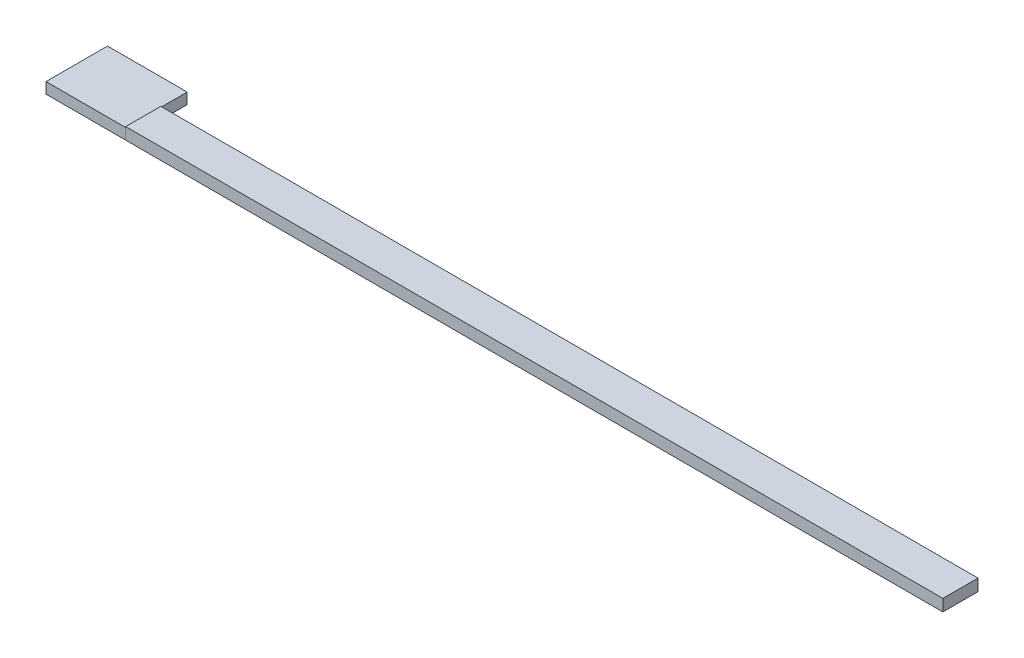
ISO-10303-21;
HEADER;
FILE_DESCRIPTION(('STEP AP214'),'2;1');
FILE_NAME('part.step','',(''),(''),'','','');
FILE_SCHEMA(('AUTOMOTIVE_DESIGN { 1 0 10303 214 1 1 1 1 }'));
ENDSEC;
DATA;
#1=APPLICATION_CONTEXT('core data for automotive mechanical design processes');
#2=APPLICATION_PROTOCOL_DEFINITION('international standard','automotive_design',2000,#1);
#3=PRODUCT_CONTEXT('',#1,'mechanical');
#4=PRODUCT('Part','Part','',(#3));
#5=PRODUCT_RELATED_PRODUCT_CATEGORY('part','',(#4));
#6=PRODUCT_DEFINITION_FORMATION('','',#4);
#7=PRODUCT_DEFINITION_CONTEXT('part definition',#1,'design');
#8=PRODUCT_DEFINITION('design','',#6,#7);
#9=PRODUCT_DEFINITION_SHAPE('','',#8);
#10=(LENGTH_UNIT() NAMED_UNIT(*) SI_UNIT(.MILLI.,.METRE.));
#11=(NAMED_UNIT(*) PLANE_ANGLE_UNIT() SI_UNIT($,.RADIAN.));
#12=(NAMED_UNIT(*) SI_UNIT($,.STERADIAN.) SOLID_ANGLE_UNIT());
#13=UNCERTAINTY_MEASURE_WITH_UNIT(LENGTH_MEASURE(1.E-05),#10,'distance_accuracy_value','');
#14=(GEOMETRIC_REPRESENTATION_CONTEXT(3) GLOBAL_UNCERTAINTY_ASSIGNED_CONTEXT((#13)) GLOBAL_UNIT_ASSIGNED_CONTEXT((#10,
#11,#12)) REPRESENTATION_CONTEXT('',''));
#15=CARTESIAN_POINT('',(0.,0.,0.));
#16=DIRECTION('',(0.,0.,1.));
#17=DIRECTION('',(1.,0.,0.));
#18=AXIS2_PLACEMENT_3D('',#15,#16,#17);
#19=CARTESIAN_POINT('',(40.,5.9,0.));
#20=DIRECTION('',(1.,0.,0.));
#21=DIRECTION('',(0.,0.,-1.));
#22=AXIS2_PLACEMENT_3D('',#19,#20,#21);
#23=PLANE('',#22);
#24=DIRECTION('',(0.,0.,1.));
#25=VECTOR('',#24,1.);
#26=CARTESIAN_POINT('',(40.,0.,0.));
#27=LINE('',#26,#25);
#28=CARTESIAN_POINT('',(40.,0.,-17.6194476069429));
#29=VERTEX_POINT('',#28);
#30=CARTESIAN_POINT('',(40.,0.,0.));
#31=VERTEX_POINT('',#30);
#32=EDGE_CURVE('E106',#29,#31,#27,.T.);
#33=ORIENTED_EDGE('',*,*,#32,.T.);
#34=DIRECTION('',(0.,-1.,0.));
#35=VECTOR('',#34,1.);
#36=CARTESIAN_POINT('',(40.,5.9,0.));
#37=LINE('',#36,#35);
#38=CARTESIAN_POINT('',(40.,5.9,0.));
#39=VERTEX_POINT('',#38);
#40=EDGE_CURVE('E12',#39,#31,#37,.T.);
#41=ORIENTED_EDGE('',*,*,#40,.F.);
#42=DIRECTION('',(0.,0.,1.));
#43=VECTOR('',#42,1.);
#44=CARTESIAN_POINT('',(40.,5.9,0.));
#45=LINE('',#44,#43);
#46=CARTESIAN_POINT('',(40.,5.9,-17.6194476069429));
#47=VERTEX_POINT('',#46);
#48=EDGE_CURVE('E94',#47,#39,#45,.T.);
#49=ORIENTED_EDGE('',*,*,#48,.F.);
#50=DIRECTION('',(0.,-1.,0.));
#51=VECTOR('',#50,1.);
#52=CARTESIAN_POINT('',(40.,5.9,-17.6194476069429));
#53=LINE('',#52,#51);
#54=EDGE_CURVE('E102',#47,#29,#53,.T.);
#55=ORIENTED_EDGE('',*,*,#54,.T.);
#56=EDGE_LOOP('',(#33,#41,#49,#55));
#57=FACE_BOUND('',#56,.T.);
#58=ADVANCED_FACE('F43',(#57),#23,.F.);
#59=CARTESIAN_POINT('',(40.,5.9,0.));
#60=DIRECTION('',(0.,0.,-1.));
#61=DIRECTION('',(-1.,0.,0.));
#62=AXIS2_PLACEMENT_3D('',#59,#60,#61);
#63=PLANE('',#62);
#64=DIRECTION('',(1.,0.,0.));
#65=VECTOR('',#64,1.);
#66=CARTESIAN_POINT('',(40.,0.,0.));
#67=LINE('',#66,#65);
#68=CARTESIAN_POINT('',(450.,0.,0.));
#69=VERTEX_POINT('',#68);
#70=EDGE_CURVE('E98',#31,#69,#67,.T.);
#71=ORIENTED_EDGE('',*,*,#70,.T.);
#72=DIRECTION('',(0.,-1.,0.));
#73=VECTOR('',#72,1.);
#74=CARTESIAN_POINT('',(450.,5.9,0.));
#75=LINE('',#74,#73);
#76=CARTESIAN_POINT('',(450.,5.9,0.));
#77=VERTEX_POINT('',#76);
#78=EDGE_CURVE('E51',#77,#69,#75,.T.);
#79=ORIENTED_EDGE('',*,*,#78,.F.);
#80=DIRECTION('',(1.,0.,0.));
#81=VECTOR('',#80,1.);
#82=CARTESIAN_POINT('',(40.,5.9,0.));
#83=LINE('',#82,#81);
#84=EDGE_CURVE('E89',#39,#77,#83,.T.);
#85=ORIENTED_EDGE('',*,*,#84,.F.);
#86=ORIENTED_EDGE('',*,*,#40,.T.);
#87=EDGE_LOOP('',(#71,#79,#85,#86));
#88=FACE_BOUND('',#87,.T.);
#89=ADVANCED_FACE('F97',(#88),#63,.F.);
#90=CARTESIAN_POINT('',(450.,5.9,0.));
#91=DIRECTION('',(-1.,0.,0.));
#92=DIRECTION('',(0.,0.,1.));
#93=AXIS2_PLACEMENT_3D('',#90,#91,#92);
#94=PLANE('',#93);
#95=DIRECTION('',(0.,0.,-1.));
#96=VECTOR('',#95,1.);
#97=CARTESIAN_POINT('',(450.,0.,0.));
#98=LINE('',#97,#96);
#99=CARTESIAN_POINT('',(450.,0.,-17.6194476069429));
#100=VERTEX_POINT('',#99);
#101=EDGE_CURVE('E76',#69,#100,#98,.T.);
#102=ORIENTED_EDGE('',*,*,#101,.T.);
#103=DIRECTION('',(0.,-1.,0.));
#104=VECTOR('',#103,1.);
#105=CARTESIAN_POINT('',(450.,5.9,-17.6194476069429));
#106=LINE('',#105,#104);
#107=CARTESIAN_POINT('',(450.,5.9,-17.6194476069429));
#108=VERTEX_POINT('',#107);
#109=EDGE_CURVE('E99',#108,#100,#106,.T.);
#110=ORIENTED_EDGE('',*,*,#109,.F.);
#111=DIRECTION('',(0.,0.,-1.));
#112=VECTOR('',#111,1.);
#113=CARTESIAN_POINT('',(450.,5.9,0.));
#114=LINE('',#113,#112);
#115=EDGE_CURVE('E92',#77,#108,#114,.T.);
#116=ORIENTED_EDGE('',*,*,#115,.F.);
#117=ORIENTED_EDGE('',*,*,#78,.T.);
#118=EDGE_LOOP('',(#102,#110,#116,#117));
#119=FACE_BOUND('',#118,.T.);
#120=ADVANCED_FACE('F100',(#119),#94,.F.);
#121=CARTESIAN_POINT('',(40.,5.9,-17.6194476069429));
#122=DIRECTION('',(0.,0.,1.));
#123=DIRECTION('',(1.,0.,0.));
#124=AXIS2_PLACEMENT_3D('',#121,#122,#123);
#125=PLANE('',#124);
#126=DIRECTION('',(-1.,0.,0.));
#127=VECTOR('',#126,1.);
#128=CARTESIAN_POINT('',(40.,0.,-17.6194476069429));
#129=LINE('',#128,#127);
#130=EDGE_CURVE('E82',#100,#29,#129,.T.);
#131=ORIENTED_EDGE('',*,*,#130,.T.);
#132=ORIENTED_EDGE('',*,*,#54,.F.);
#133=DIRECTION('',(-1.,0.,0.));
#134=VECTOR('',#133,1.);
#135=CARTESIAN_POINT('',(40.,5.9,-17.6194476069429));
#136=LINE('',#135,#134);
#137=EDGE_CURVE('E59',#108,#47,#136,.T.);
#138=ORIENTED_EDGE('',*,*,#137,.F.);
#139=ORIENTED_EDGE('',*,*,#109,.T.);
#140=EDGE_LOOP('',(#131,#132,#138,#139));
#141=FACE_BOUND('',#140,.T.);
#142=ADVANCED_FACE('F113',(#141),#125,.F.);
#143=CARTESIAN_POINT('',(0.,5.9,0.));
#144=DIRECTION('',(0.,-1.,0.));
#145=DIRECTION('',(0.,0.,-1.));
#146=AXIS2_PLACEMENT_3D('',#143,#144,#145);
#147=PLANE('',#146);
#148=ORIENTED_EDGE('',*,*,#48,.T.);
#149=ORIENTED_EDGE('',*,*,#84,.T.);
#150=ORIENTED_EDGE('',*,*,#115,.T.);
#151=ORIENTED_EDGE('',*,*,#137,.T.);
#152=EDGE_LOOP('',(#148,#149,#150,#151));
#153=FACE_BOUND('',#152,.T.);
#154=ADVANCED_FACE('F90',(#153),#147,.F.);
#155=CARTESIAN_POINT('',(0.,0.,0.));
#156=DIRECTION('',(0.,-1.,0.));
#157=DIRECTION('',(0.,0.,-1.));
#158=AXIS2_PLACEMENT_3D('',#155,#156,#157);
#159=PLANE('',#158);
#160=ORIENTED_EDGE('',*,*,#32,.F.);
#161=ORIENTED_EDGE('',*,*,#130,.F.);
#162=ORIENTED_EDGE('',*,*,#101,.F.);
#163=ORIENTED_EDGE('',*,*,#70,.F.);
#164=EDGE_LOOP('',(#160,#161,#162,#163));
#165=FACE_BOUND('',#164,.T.);
#166=ADVANCED_FACE('F116',(#165),#159,.T.);
#167=CLOSED_SHELL('',(#58,#89,#120,#142,#154,#166));
#168=MANIFOLD_SOLID_BREP('B2',#167);
#169=CARTESIAN_POINT('',(0.,5.47,0.));
#170=DIRECTION('',(1.,0.,0.));
#171=DIRECTION('',(0.,0.,-1.));
#172=AXIS2_PLACEMENT_3D('',#169,#170,#171);
#173=PLANE('',#172);
#174=DIRECTION('',(0.,0.,1.));
#175=VECTOR('',#174,1.);
#176=CARTESIAN_POINT('',(0.,0.,0.));
#177=LINE('',#176,#175);
#178=CARTESIAN_POINT('',(0.,0.,-30.8655015115774));
#179=VERTEX_POINT('',#178);
#180=CARTESIAN_POINT('',(0.,0.,0.));
#181=VERTEX_POINT('',#180);
#182=EDGE_CURVE('E230',#179,#181,#177,.T.);
#183=ORIENTED_EDGE('',*,*,#182,.T.);
#184=DIRECTION('',(0.,-1.,0.));
#185=VECTOR('',#184,1.);
#186=CARTESIAN_POINT('',(0.,5.47,0.));
#187=LINE('',#186,#185);
#188=CARTESIAN_POINT('',(0.,5.47,0.));
#189=VERTEX_POINT('',#188);
#190=EDGE_CURVE('E41',#189,#181,#187,.T.);
#191=ORIENTED_EDGE('',*,*,#190,.F.);
#192=DIRECTION('',(0.,0.,1.));
#193=VECTOR('',#192,1.);
#194=CARTESIAN_POINT('',(0.,5.47,0.));
#195=LINE('',#194,#193);
#196=CARTESIAN_POINT('',(0.,5.47,-30.8655015115774));
#197=VERTEX_POINT('',#196);
#198=EDGE_CURVE('E218',#197,#189,#195,.T.);
#199=ORIENTED_EDGE('',*,*,#198,.F.);
#200=DIRECTION('',(0.,-1.,0.));
#201=VECTOR('',#200,1.);
#202=CARTESIAN_POINT('',(0.,5.47,-30.8655015115774));
#203=LINE('',#202,#201);
#204=EDGE_CURVE('E226',#197,#179,#203,.T.);
#205=ORIENTED_EDGE('',*,*,#204,.T.);
#206=EDGE_LOOP('',(#183,#191,#199,#205));
#207=FACE_BOUND('',#206,.T.);
#208=ADVANCED_FACE('F167',(#207),#173,.F.);
#209=CARTESIAN_POINT('',(0.,5.47,0.));
#210=DIRECTION('',(0.,0.,-1.));
#211=DIRECTION('',(-1.,0.,0.));
#212=AXIS2_PLACEMENT_3D('',#209,#210,#211);
#213=PLANE('',#212);
#214=DIRECTION('',(1.,0.,0.));
#215=VECTOR('',#214,1.);
#216=CARTESIAN_POINT('',(0.,0.,0.));
#217=LINE('',#216,#215);
#218=CARTESIAN_POINT('',(40.,0.,0.));
#219=VERTEX_POINT('',#218);
#220=EDGE_CURVE('E222',#181,#219,#217,.T.);
#221=ORIENTED_EDGE('',*,*,#220,.T.);
#222=DIRECTION('',(0.,-1.,0.));
#223=VECTOR('',#222,1.);
#224=CARTESIAN_POINT('',(40.,5.47,0.));
#225=LINE('',#224,#223);
#226=CARTESIAN_POINT('',(40.,5.47,0.));
#227=VERTEX_POINT('',#226);
#228=EDGE_CURVE('E175',#227,#219,#225,.T.);
#229=ORIENTED_EDGE('',*,*,#228,.F.);
#230=DIRECTION('',(1.,0.,0.));
#231=VECTOR('',#230,1.);
#232=CARTESIAN_POINT('',(0.,5.47,0.));
#233=LINE('',#232,#231);
#234=EDGE_CURVE('E213',#189,#227,#233,.T.);
#235=ORIENTED_EDGE('',*,*,#234,.F.);
#236=ORIENTED_EDGE('',*,*,#190,.T.);
#237=EDGE_LOOP('',(#221,#229,#235,#236));
#238=FACE_BOUND('',#237,.T.);
#239=ADVANCED_FACE('F221',(#238),#213,.F.);
#240=CARTESIAN_POINT('',(40.,5.47,0.));
#241=DIRECTION('',(-1.,0.,0.));
#242=DIRECTION('',(0.,0.,1.));
#243=AXIS2_PLACEMENT_3D('',#240,#241,#242);
#244=PLANE('',#243);
#245=DIRECTION('',(0.,0.,-1.));
#246=VECTOR('',#245,1.);
#247=CARTESIAN_POINT('',(40.,0.,0.));
#248=LINE('',#247,#246);
#249=CARTESIAN_POINT('',(40.,0.,-30.8655015115774));
#250=VERTEX_POINT('',#249);
#251=EDGE_CURVE('E200',#219,#250,#248,.T.);
#252=ORIENTED_EDGE('',*,*,#251,.T.);
#253=DIRECTION('',(0.,-1.,0.));
#254=VECTOR('',#253,1.);
#255=CARTESIAN_POINT('',(40.,5.47,-30.8655015115774));
#256=LINE('',#255,#254);
#257=CARTESIAN_POINT('',(40.,5.47,-30.8655015115774));
#258=VERTEX_POINT('',#257);
#259=EDGE_CURVE('E223',#258,#250,#256,.T.);
#260=ORIENTED_EDGE('',*,*,#259,.F.);
#261=DIRECTION('',(0.,0.,-1.));
#262=VECTOR('',#261,1.);
#263=CARTESIAN_POINT('',(40.,5.47,0.));
#264=LINE('',#263,#262);
#265=EDGE_CURVE('E216',#227,#258,#264,.T.);
#266=ORIENTED_EDGE('',*,*,#265,.F.);
#267=ORIENTED_EDGE('',*,*,#228,.T.);
#268=EDGE_LOOP('',(#252,#260,#266,#267));
#269=FACE_BOUND('',#268,.T.);
#270=ADVANCED_FACE('F224',(#269),#244,.F.);
#271=CARTESIAN_POINT('',(0.,5.47,-30.8655015115774));
#272=DIRECTION('',(0.,0.,1.));
#273=DIRECTION('',(1.,0.,0.));
#274=AXIS2_PLACEMENT_3D('',#271,#272,#273);
#275=PLANE('',#274);
#276=DIRECTION('',(-1.,0.,0.));
#277=VECTOR('',#276,1.);
#278=CARTESIAN_POINT('',(0.,0.,-30.8655015115774));
#279=LINE('',#278,#277);
#280=EDGE_CURVE('E206',#250,#179,#279,.T.);
#281=ORIENTED_EDGE('',*,*,#280,.T.);
#282=ORIENTED_EDGE('',*,*,#204,.F.);
#283=DIRECTION('',(-1.,0.,0.));
#284=VECTOR('',#283,1.);
#285=CARTESIAN_POINT('',(0.,5.47,-30.8655015115774));
#286=LINE('',#285,#284);
#287=EDGE_CURVE('E183',#258,#197,#286,.T.);
#288=ORIENTED_EDGE('',*,*,#287,.F.);
#289=ORIENTED_EDGE('',*,*,#259,.T.);
#290=EDGE_LOOP('',(#281,#282,#288,#289));
#291=FACE_BOUND('',#290,.T.);
#292=ADVANCED_FACE('F237',(#291),#275,.F.);
#293=CARTESIAN_POINT('',(0.,5.47,0.));
#294=DIRECTION('',(0.,-1.,0.));
#295=DIRECTION('',(0.,0.,-1.));
#296=AXIS2_PLACEMENT_3D('',#293,#294,#295);
#297=PLANE('',#296);
#298=ORIENTED_EDGE('',*,*,#198,.T.);
#299=ORIENTED_EDGE('',*,*,#234,.T.);
#300=ORIENTED_EDGE('',*,*,#265,.T.);
#301=ORIENTED_EDGE('',*,*,#287,.T.);
#302=EDGE_LOOP('',(#298,#299,#300,#301));
#303=FACE_BOUND('',#302,.T.);
#304=ADVANCED_FACE('F214',(#303),#297,.F.);
#305=CARTESIAN_POINT('',(0.,0.,0.));
#306=DIRECTION('',(0.,-1.,0.));
#307=DIRECTION('',(0.,0.,-1.));
#308=AXIS2_PLACEMENT_3D('',#305,#306,#307);
#309=PLANE('',#308);
#310=ORIENTED_EDGE('',*,*,#182,.F.);
#311=ORIENTED_EDGE('',*,*,#280,.F.);
#312=ORIENTED_EDGE('',*,*,#251,.F.);
#313=ORIENTED_EDGE('',*,*,#220,.F.);
#314=EDGE_LOOP('',(#310,#311,#312,#313));
#315=FACE_BOUND('',#314,.T.);
#316=ADVANCED_FACE('F240',(#315),#309,.T.);
#317=CLOSED_SHELL('',(#208,#239,#270,#292,#304,#316));
#318=MANIFOLD_SOLID_BREP('B6',#317);
#319=ADVANCED_BREP_SHAPE_REPRESENTATION('',(#18,#168,#318),#14);
#320=SHAPE_DEFINITION_REPRESENTATION(#9,#319);
ENDSEC;
END-ISO-10303-21;
